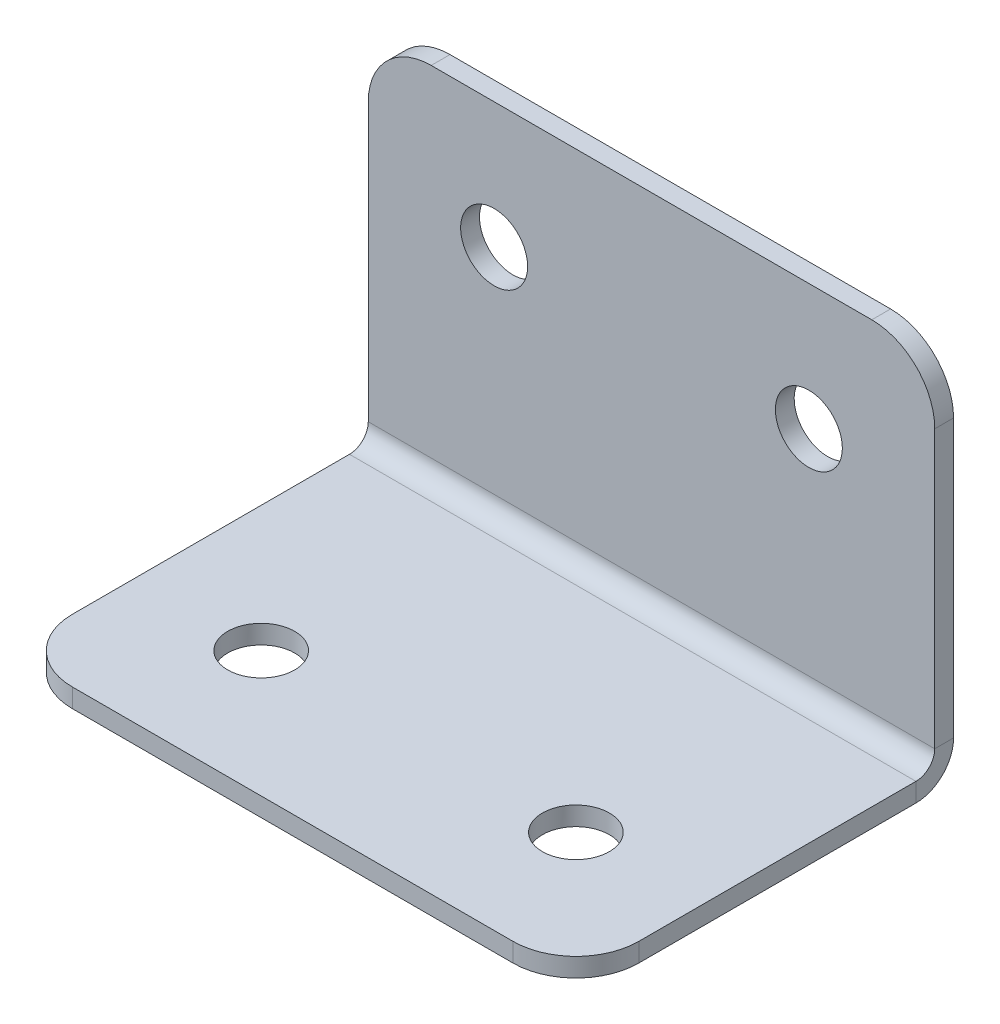
ISO-10303-21;
HEADER;
FILE_DESCRIPTION(('STEP AP214'),'2;1');
FILE_NAME('part.step','',(''),(''),'','','');
FILE_SCHEMA(('AUTOMOTIVE_DESIGN { 1 0 10303 214 1 1 1 1 }'));
ENDSEC;
DATA;
#1=APPLICATION_CONTEXT('core data for automotive mechanical design processes');
#2=APPLICATION_PROTOCOL_DEFINITION('international standard','automotive_design',2000,#1);
#3=PRODUCT_CONTEXT('',#1,'mechanical');
#4=PRODUCT('Part','Part','',(#3));
#5=PRODUCT_RELATED_PRODUCT_CATEGORY('part','',(#4));
#6=PRODUCT_DEFINITION_FORMATION('','',#4);
#7=PRODUCT_DEFINITION_CONTEXT('part definition',#1,'design');
#8=PRODUCT_DEFINITION('design','',#6,#7);
#9=PRODUCT_DEFINITION_SHAPE('','',#8);
#10=(LENGTH_UNIT() NAMED_UNIT(*) SI_UNIT(.MILLI.,.METRE.));
#11=(NAMED_UNIT(*) PLANE_ANGLE_UNIT() SI_UNIT($,.RADIAN.));
#12=(NAMED_UNIT(*) SI_UNIT($,.STERADIAN.) SOLID_ANGLE_UNIT());
#13=UNCERTAINTY_MEASURE_WITH_UNIT(LENGTH_MEASURE(1.E-05),#10,'distance_accuracy_value','');
#14=(GEOMETRIC_REPRESENTATION_CONTEXT(3) GLOBAL_UNCERTAINTY_ASSIGNED_CONTEXT((#13)) GLOBAL_UNIT_ASSIGNED_CONTEXT((#10,
#11,#12)) REPRESENTATION_CONTEXT('',''));
#15=CARTESIAN_POINT('',(0.,0.,0.));
#16=DIRECTION('',(0.,0.,1.));
#17=DIRECTION('',(1.,0.,0.));
#18=AXIS2_PLACEMENT_3D('',#15,#16,#17);
#19=CARTESIAN_POINT('',(28.575,1.89738,38.1));
#20=DIRECTION('',(-1.,0.,0.));
#21=DIRECTION('',(0.,0.,1.));
#22=AXIS2_PLACEMENT_3D('',#19,#20,#21);
#23=PLANE('',#22);
#24=DIRECTION('',(0.,0.,-1.));
#25=VECTOR('',#24,1.);
#26=CARTESIAN_POINT('',(28.575,1.89738,38.1));
#27=LINE('',#26,#25);
#28=CARTESIAN_POINT('',(28.575,1.89738,31.75));
#29=VERTEX_POINT('',#28);
#30=CARTESIAN_POINT('',(28.575,1.89737999999998,3.79475999999999));
#31=VERTEX_POINT('',#30);
#32=EDGE_CURVE('E209',#29,#31,#27,.T.);
#33=ORIENTED_EDGE('',*,*,#32,.F.);
#34=DIRECTION('',(0.,-1.,0.));
#35=VECTOR('',#34,1.);
#36=CARTESIAN_POINT('',(28.575,1.89738,31.75));
#37=LINE('',#36,#35);
#38=CARTESIAN_POINT('',(28.575,0.,31.75));
#39=VERTEX_POINT('',#38);
#40=EDGE_CURVE('E218',#29,#39,#37,.T.);
#41=ORIENTED_EDGE('',*,*,#40,.T.);
#42=DIRECTION('',(0.,0.,-1.));
#43=VECTOR('',#42,1.);
#44=CARTESIAN_POINT('',(28.575,0.,38.1));
#45=LINE('',#44,#43);
#46=CARTESIAN_POINT('',(28.575,0.,3.79475999999999));
#47=VERTEX_POINT('',#46);
#48=EDGE_CURVE('E207',#39,#47,#45,.T.);
#49=ORIENTED_EDGE('',*,*,#48,.T.);
#50=DIRECTION('',(0.,-1.,0.));
#51=VECTOR('',#50,1.);
#52=CARTESIAN_POINT('',(28.575,1.89737999999998,3.79475999999999));
#53=LINE('',#52,#51);
#54=EDGE_CURVE('E204',#31,#47,#53,.T.);
#55=ORIENTED_EDGE('',*,*,#54,.F.);
#56=EDGE_LOOP('',(#33,#41,#49,#55));
#57=FACE_BOUND('',#56,.T.);
#58=ADVANCED_FACE('F56',(#57),#23,.F.);
#59=CARTESIAN_POINT('',(-28.575,1.89738,38.1));
#60=DIRECTION('',(1.,0.,0.));
#61=DIRECTION('',(0.,0.,-1.));
#62=AXIS2_PLACEMENT_3D('',#59,#60,#61);
#63=PLANE('',#62);
#64=DIRECTION('',(0.,0.,1.));
#65=VECTOR('',#64,1.);
#66=CARTESIAN_POINT('',(-28.575,0.,38.1));
#67=LINE('',#66,#65);
#68=CARTESIAN_POINT('',(-28.575,0.,3.79475999999999));
#69=VERTEX_POINT('',#68);
#70=CARTESIAN_POINT('',(-28.575,0.,31.75));
#71=VERTEX_POINT('',#70);
#72=EDGE_CURVE('E220',#69,#71,#67,.T.);
#73=ORIENTED_EDGE('',*,*,#72,.T.);
#74=DIRECTION('',(0.,-1.,0.));
#75=VECTOR('',#74,1.);
#76=CARTESIAN_POINT('',(-28.575,1.89738,31.75));
#77=LINE('',#76,#75);
#78=CARTESIAN_POINT('',(-28.575,1.89738,31.75));
#79=VERTEX_POINT('',#78);
#80=EDGE_CURVE('E240',#71,#79,#77,.F.);
#81=ORIENTED_EDGE('',*,*,#80,.T.);
#82=DIRECTION('',(0.,0.,1.));
#83=VECTOR('',#82,1.);
#84=CARTESIAN_POINT('',(-28.575,1.89738,38.1));
#85=LINE('',#84,#83);
#86=CARTESIAN_POINT('',(-28.575,1.89737999999998,3.79475999999999));
#87=VERTEX_POINT('',#86);
#88=EDGE_CURVE('E211',#87,#79,#85,.T.);
#89=ORIENTED_EDGE('',*,*,#88,.F.);
#90=DIRECTION('',(0.,-1.,0.));
#91=VECTOR('',#90,1.);
#92=CARTESIAN_POINT('',(-28.575,1.89737999999998,3.79475999999999));
#93=LINE('',#92,#91);
#94=EDGE_CURVE('E196',#87,#69,#93,.T.);
#95=ORIENTED_EDGE('',*,*,#94,.T.);
#96=EDGE_LOOP('',(#73,#81,#89,#95));
#97=FACE_BOUND('',#96,.T.);
#98=ADVANCED_FACE('F286',(#97),#63,.F.);
#99=CARTESIAN_POINT('',(0.,1.89738,0.));
#100=DIRECTION('',(0.,-1.,0.));
#101=DIRECTION('',(0.,0.,-1.));
#102=AXIS2_PLACEMENT_3D('',#99,#100,#101);
#103=PLANE('',#102);
#104=CARTESIAN_POINT('',(-15.875,1.89738,25.4));
#105=DIRECTION('',(0.,1.,0.));
#106=DIRECTION('',(0.,0.,1.));
#107=AXIS2_PLACEMENT_3D('',#104,#105,#106);
#108=CIRCLE('',#107,3.3782);
#109=CARTESIAN_POINT('',(-15.875,1.89738,28.7782));
#110=VERTEX_POINT('',#109);
#111=EDGE_CURVE('E369',#110,#110,#108,.T.);
#112=ORIENTED_EDGE('',*,*,#111,.F.);
#113=EDGE_LOOP('',(#112));
#114=FACE_BOUND('',#113,.T.);
#115=CARTESIAN_POINT('',(15.875,1.89738,25.4));
#116=DIRECTION('',(0.,1.,0.));
#117=DIRECTION('',(0.,0.,1.));
#118=AXIS2_PLACEMENT_3D('',#115,#116,#117);
#119=CIRCLE('',#118,3.3782);
#120=CARTESIAN_POINT('',(15.875,1.89738,28.7782));
#121=VERTEX_POINT('',#120);
#122=EDGE_CURVE('E381',#121,#121,#119,.T.);
#123=ORIENTED_EDGE('',*,*,#122,.F.);
#124=EDGE_LOOP('',(#123));
#125=FACE_BOUND('',#124,.T.);
#126=DIRECTION('',(1.,0.,0.));
#127=VECTOR('',#126,1.);
#128=CARTESIAN_POINT('',(-28.575,1.89738,38.1));
#129=LINE('',#128,#127);
#130=CARTESIAN_POINT('',(-22.225,1.89738,38.1));
#131=VERTEX_POINT('',#130);
#132=CARTESIAN_POINT('',(22.225,1.89738,38.1));
#133=VERTEX_POINT('',#132);
#134=EDGE_CURVE('E215',#131,#133,#129,.T.);
#135=ORIENTED_EDGE('',*,*,#134,.T.);
#136=CARTESIAN_POINT('',(22.225,1.89738,31.75));
#137=DIRECTION('',(0.,-1.,0.));
#138=DIRECTION('',(0.,0.,-1.));
#139=AXIS2_PLACEMENT_3D('',#136,#137,#138);
#140=CIRCLE('',#139,6.35);
#141=EDGE_CURVE('E238',#133,#29,#140,.F.);
#142=ORIENTED_EDGE('',*,*,#141,.T.);
#143=ORIENTED_EDGE('',*,*,#32,.T.);
#144=DIRECTION('',(-1.,0.,0.));
#145=VECTOR('',#144,1.);
#146=CARTESIAN_POINT('',(-28.575,1.89737999999998,3.79475999999999));
#147=LINE('',#146,#145);
#148=EDGE_CURVE('E200',#87,#31,#147,.F.);
#149=ORIENTED_EDGE('',*,*,#148,.F.);
#150=ORIENTED_EDGE('',*,*,#88,.T.);
#151=CARTESIAN_POINT('',(-22.225,1.89738,31.75));
#152=DIRECTION('',(0.,-1.,0.));
#153=DIRECTION('',(0.,0.,-1.));
#154=AXIS2_PLACEMENT_3D('',#151,#152,#153);
#155=CIRCLE('',#154,6.35);
#156=EDGE_CURVE('E236',#79,#131,#155,.F.);
#157=ORIENTED_EDGE('',*,*,#156,.T.);
#158=EDGE_LOOP('',(#135,#142,#143,#149,#150,#157));
#159=FACE_BOUND('',#158,.T.);
#160=ADVANCED_FACE('F294',(#114,#125,#159),#103,.F.);
#161=CARTESIAN_POINT('',(0.,0.,0.));
#162=DIRECTION('',(0.,-1.,0.));
#163=DIRECTION('',(0.,0.,-1.));
#164=AXIS2_PLACEMENT_3D('',#161,#162,#163);
#165=PLANE('',#164);
#166=CARTESIAN_POINT('',(-15.875,0.,25.4));
#167=DIRECTION('',(0.,-1.,0.));
#168=DIRECTION('',(0.,0.,-1.));
#169=AXIS2_PLACEMENT_3D('',#166,#167,#168);
#170=CIRCLE('',#169,3.3782);
#171=CARTESIAN_POINT('',(-15.875,0.,22.0218));
#172=VERTEX_POINT('',#171);
#173=EDGE_CURVE('E378',#172,#172,#170,.T.);
#174=ORIENTED_EDGE('',*,*,#173,.F.);
#175=EDGE_LOOP('',(#174));
#176=FACE_BOUND('',#175,.T.);
#177=CARTESIAN_POINT('',(15.875,0.,25.4));
#178=DIRECTION('',(0.,-1.,0.));
#179=DIRECTION('',(0.,0.,-1.));
#180=AXIS2_PLACEMENT_3D('',#177,#178,#179);
#181=CIRCLE('',#180,3.3782);
#182=CARTESIAN_POINT('',(15.875,0.,22.0218));
#183=VERTEX_POINT('',#182);
#184=EDGE_CURVE('E193',#183,#183,#181,.T.);
#185=ORIENTED_EDGE('',*,*,#184,.F.);
#186=EDGE_LOOP('',(#185));
#187=FACE_BOUND('',#186,.T.);
#188=ORIENTED_EDGE('',*,*,#48,.F.);
#189=CARTESIAN_POINT('',(22.225,0.,31.75));
#190=DIRECTION('',(0.,-1.,0.));
#191=DIRECTION('',(0.,0.,-1.));
#192=AXIS2_PLACEMENT_3D('',#189,#190,#191);
#193=CIRCLE('',#192,6.35);
#194=CARTESIAN_POINT('',(22.225,0.,38.1));
#195=VERTEX_POINT('',#194);
#196=EDGE_CURVE('E229',#39,#195,#193,.T.);
#197=ORIENTED_EDGE('',*,*,#196,.T.);
#198=DIRECTION('',(1.,0.,0.));
#199=VECTOR('',#198,1.);
#200=CARTESIAN_POINT('',(-28.575,0.,38.1));
#201=LINE('',#200,#199);
#202=CARTESIAN_POINT('',(-22.225,0.,38.1));
#203=VERTEX_POINT('',#202);
#204=EDGE_CURVE('E212',#203,#195,#201,.T.);
#205=ORIENTED_EDGE('',*,*,#204,.F.);
#206=CARTESIAN_POINT('',(-22.225,0.,31.75));
#207=DIRECTION('',(0.,-1.,0.));
#208=DIRECTION('',(0.,0.,-1.));
#209=AXIS2_PLACEMENT_3D('',#206,#207,#208);
#210=CIRCLE('',#209,6.35);
#211=EDGE_CURVE('E227',#203,#71,#210,.T.);
#212=ORIENTED_EDGE('',*,*,#211,.T.);
#213=ORIENTED_EDGE('',*,*,#72,.F.);
#214=DIRECTION('',(-1.,0.,0.));
#215=VECTOR('',#214,1.);
#216=CARTESIAN_POINT('',(-28.575,0.,3.79475999999999));
#217=LINE('',#216,#215);
#218=EDGE_CURVE('E156',#69,#47,#217,.F.);
#219=ORIENTED_EDGE('',*,*,#218,.T.);
#220=EDGE_LOOP('',(#188,#197,#205,#212,#213,#219));
#221=FACE_BOUND('',#220,.T.);
#222=ADVANCED_FACE('F281',(#176,#187,#221),#165,.T.);
#223=CARTESIAN_POINT('',(-28.575,1.89738,38.1));
#224=DIRECTION('',(0.,0.,-1.));
#225=DIRECTION('',(-1.,0.,0.));
#226=AXIS2_PLACEMENT_3D('',#223,#224,#225);
#227=PLANE('',#226);
#228=ORIENTED_EDGE('',*,*,#204,.T.);
#229=DIRECTION('',(0.,-1.,0.));
#230=VECTOR('',#229,1.);
#231=CARTESIAN_POINT('',(22.225,1.89738,38.1));
#232=LINE('',#231,#230);
#233=EDGE_CURVE('E234',#195,#133,#232,.F.);
#234=ORIENTED_EDGE('',*,*,#233,.T.);
#235=ORIENTED_EDGE('',*,*,#134,.F.);
#236=DIRECTION('',(0.,-1.,0.));
#237=VECTOR('',#236,1.);
#238=CARTESIAN_POINT('',(-22.225,1.89738,38.1));
#239=LINE('',#238,#237);
#240=EDGE_CURVE('E231',#131,#203,#239,.T.);
#241=ORIENTED_EDGE('',*,*,#240,.T.);
#242=EDGE_LOOP('',(#228,#234,#235,#241));
#243=FACE_BOUND('',#242,.T.);
#244=ADVANCED_FACE('F297',(#243),#227,.F.);
#245=CARTESIAN_POINT('',(28.575,3.79475999999998,3.79475999999999));
#246=DIRECTION('',(1.,0.,0.));
#247=DIRECTION('',(0.,0.,-1.));
#248=AXIS2_PLACEMENT_3D('',#245,#246,#247);
#249=PLANE('',#248);
#250=DIRECTION('',(0.,0.,1.));
#251=VECTOR('',#250,1.);
#252=CARTESIAN_POINT('',(28.575,3.79476000000001,0.));
#253=LINE('',#252,#251);
#254=CARTESIAN_POINT('',(28.575,3.79475999999997,1.89737999999999));
#255=VERTEX_POINT('',#254);
#256=CARTESIAN_POINT('',(28.575,3.79475999999997,0.));
#257=VERTEX_POINT('',#256);
#258=EDGE_CURVE('E190',#255,#257,#253,.F.);
#259=ORIENTED_EDGE('',*,*,#258,.F.);
#260=CARTESIAN_POINT('',(28.575,3.79475999999998,3.79475999999999));
#261=DIRECTION('',(-1.,0.,0.));
#262=DIRECTION('',(0.,0.,1.));
#263=AXIS2_PLACEMENT_3D('',#260,#261,#262);
#264=CIRCLE('',#263,1.89738);
#265=EDGE_CURVE('E159',#31,#255,#264,.F.);
#266=ORIENTED_EDGE('',*,*,#265,.F.);
#267=ORIENTED_EDGE('',*,*,#54,.T.);
#268=CARTESIAN_POINT('',(28.575,3.79475999999998,3.79475999999999));
#269=DIRECTION('',(-1.,0.,0.));
#270=DIRECTION('',(0.,0.,1.));
#271=AXIS2_PLACEMENT_3D('',#268,#269,#270);
#272=CIRCLE('',#271,3.79476);
#273=EDGE_CURVE('E195',#47,#257,#272,.F.);
#274=ORIENTED_EDGE('',*,*,#273,.T.);
#275=EDGE_LOOP('',(#259,#266,#267,#274));
#276=FACE_BOUND('',#275,.T.);
#277=ADVANCED_FACE('F275',(#276),#249,.T.);
#278=CARTESIAN_POINT('',(-28.575,3.79475999999998,3.79475999999999));
#279=DIRECTION('',(1.,0.,0.));
#280=DIRECTION('',(0.,0.,-1.));
#281=AXIS2_PLACEMENT_3D('',#278,#279,#280);
#282=PLANE('',#281);
#283=CARTESIAN_POINT('',(-28.575,3.79475999999998,3.79475999999999));
#284=DIRECTION('',(-1.,0.,0.));
#285=DIRECTION('',(0.,0.,1.));
#286=AXIS2_PLACEMENT_3D('',#283,#284,#285);
#287=CIRCLE('',#286,1.89738);
#288=CARTESIAN_POINT('',(-28.575,3.79475999999997,1.89737999999999));
#289=VERTEX_POINT('',#288);
#290=EDGE_CURVE('E166',#289,#87,#287,.T.);
#291=ORIENTED_EDGE('',*,*,#290,.F.);
#292=DIRECTION('',(0.,0.,1.));
#293=VECTOR('',#292,1.);
#294=CARTESIAN_POINT('',(-28.575,3.79475999999999,1.89737999999999));
#295=LINE('',#294,#293);
#296=CARTESIAN_POINT('',(-28.575,3.79476000000001,0.));
#297=VERTEX_POINT('',#296);
#298=EDGE_CURVE('E163',#289,#297,#295,.F.);
#299=ORIENTED_EDGE('',*,*,#298,.T.);
#300=CARTESIAN_POINT('',(-28.575,3.79475999999998,3.79475999999999));
#301=DIRECTION('',(-1.,0.,0.));
#302=DIRECTION('',(0.,0.,1.));
#303=AXIS2_PLACEMENT_3D('',#300,#301,#302);
#304=CIRCLE('',#303,3.79476);
#305=EDGE_CURVE('E148',#297,#69,#304,.T.);
#306=ORIENTED_EDGE('',*,*,#305,.T.);
#307=ORIENTED_EDGE('',*,*,#94,.F.);
#308=EDGE_LOOP('',(#291,#299,#306,#307));
#309=FACE_BOUND('',#308,.T.);
#310=ADVANCED_FACE('F164',(#309),#282,.F.);
#311=CARTESIAN_POINT('',(-28.575,3.79475999999998,3.79475999999999));
#312=DIRECTION('',(-1.,0.,0.));
#313=DIRECTION('',(0.,0.,-1.));
#314=AXIS2_PLACEMENT_3D('',#311,#312,#313);
#315=CYLINDRICAL_SURFACE('',#314,3.79476);
#316=ORIENTED_EDGE('',*,*,#218,.F.);
#317=ORIENTED_EDGE('',*,*,#305,.F.);
#318=DIRECTION('',(-1.,0.,0.));
#319=VECTOR('',#318,1.);
#320=CARTESIAN_POINT('',(28.575,3.79476000000001,0.));
#321=LINE('',#320,#319);
#322=EDGE_CURVE('E153',#297,#257,#321,.F.);
#323=ORIENTED_EDGE('',*,*,#322,.T.);
#324=ORIENTED_EDGE('',*,*,#273,.F.);
#325=EDGE_LOOP('',(#316,#317,#323,#324));
#326=FACE_BOUND('',#325,.T.);
#327=ADVANCED_FACE('F150',(#326),#315,.T.);
#328=CARTESIAN_POINT('',(-28.575,3.79475999999998,3.79475999999999));
#329=DIRECTION('',(-1.,0.,0.));
#330=DIRECTION('',(0.,0.,-1.));
#331=AXIS2_PLACEMENT_3D('',#328,#329,#330);
#332=CYLINDRICAL_SURFACE('',#331,1.89738);
#333=ORIENTED_EDGE('',*,*,#148,.T.);
#334=ORIENTED_EDGE('',*,*,#265,.T.);
#335=DIRECTION('',(-1.,0.,0.));
#336=VECTOR('',#335,1.);
#337=CARTESIAN_POINT('',(28.575,3.79475999999999,1.89737999999999));
#338=LINE('',#337,#336);
#339=EDGE_CURVE('E168',#255,#289,#338,.T.);
#340=ORIENTED_EDGE('',*,*,#339,.T.);
#341=ORIENTED_EDGE('',*,*,#290,.T.);
#342=EDGE_LOOP('',(#333,#334,#340,#341));
#343=FACE_BOUND('',#342,.T.);
#344=ADVANCED_FACE('F270',(#343),#332,.F.);
#345=CARTESIAN_POINT('',(28.575,1.89737999999999,0.));
#346=DIRECTION('',(-1.,0.,0.));
#347=DIRECTION('',(0.,0.,1.));
#348=AXIS2_PLACEMENT_3D('',#345,#346,#347);
#349=PLANE('',#348);
#350=DIRECTION('',(0.,-1.,0.));
#351=VECTOR('',#350,1.);
#352=CARTESIAN_POINT('',(28.575,0.,0.));
#353=LINE('',#352,#351);
#354=CARTESIAN_POINT('',(28.575,31.75,-1.03548854600011E-13));
#355=VERTEX_POINT('',#354);
#356=EDGE_CURVE('E173',#355,#257,#353,.T.);
#357=ORIENTED_EDGE('',*,*,#356,.F.);
#358=DIRECTION('',(0.,0.,1.));
#359=VECTOR('',#358,1.);
#360=CARTESIAN_POINT('',(28.575,31.75,-1.03579344342084E-13));
#361=LINE('',#360,#359);
#362=CARTESIAN_POINT('',(28.575,31.75,1.8973799999999));
#363=VERTEX_POINT('',#362);
#364=EDGE_CURVE('E13',#355,#363,#361,.T.);
#365=ORIENTED_EDGE('',*,*,#364,.T.);
#366=DIRECTION('',(0.,1.,0.));
#367=VECTOR('',#366,1.);
#368=CARTESIAN_POINT('',(28.575,1.89738,1.89738));
#369=LINE('',#368,#367);
#370=EDGE_CURVE('E174',#363,#255,#369,.F.);
#371=ORIENTED_EDGE('',*,*,#370,.T.);
#372=ORIENTED_EDGE('',*,*,#258,.T.);
#373=EDGE_LOOP('',(#357,#365,#371,#372));
#374=FACE_BOUND('',#373,.T.);
#375=ADVANCED_FACE('F267',(#374),#349,.F.);
#376=CARTESIAN_POINT('',(-28.575,38.1,-1.25984292442816E-13));
#377=DIRECTION('',(1.,0.,0.));
#378=DIRECTION('',(0.,0.,-1.));
#379=AXIS2_PLACEMENT_3D('',#376,#377,#378);
#380=PLANE('',#379);
#381=DIRECTION('',(0.,-1.,0.));
#382=VECTOR('',#381,1.);
#383=CARTESIAN_POINT('',(-28.575,38.1,1.89737999999987));
#384=LINE('',#383,#382);
#385=CARTESIAN_POINT('',(-28.575,31.75,1.8973799999999));
#386=VERTEX_POINT('',#385);
#387=EDGE_CURVE('E186',#289,#386,#384,.F.);
#388=ORIENTED_EDGE('',*,*,#387,.T.);
#389=DIRECTION('',(0.,0.,1.));
#390=VECTOR('',#389,1.);
#391=CARTESIAN_POINT('',(-28.575,31.75,-1.03813385941162E-13));
#392=LINE('',#391,#390);
#393=CARTESIAN_POINT('',(-28.575,31.75,-1.03848741739719E-13));
#394=VERTEX_POINT('',#393);
#395=EDGE_CURVE('E79',#386,#394,#392,.F.);
#396=ORIENTED_EDGE('',*,*,#395,.T.);
#397=DIRECTION('',(0.,1.,0.));
#398=VECTOR('',#397,1.);
#399=CARTESIAN_POINT('',(-28.575,0.,0.));
#400=LINE('',#399,#398);
#401=EDGE_CURVE('E171',#297,#394,#400,.T.);
#402=ORIENTED_EDGE('',*,*,#401,.F.);
#403=ORIENTED_EDGE('',*,*,#298,.F.);
#404=EDGE_LOOP('',(#388,#396,#402,#403));
#405=FACE_BOUND('',#404,.T.);
#406=ADVANCED_FACE('F176',(#405),#380,.F.);
#407=CARTESIAN_POINT('',(0.,0.,0.));
#408=DIRECTION('',(0.,0.,1.));
#409=DIRECTION('',(0.,-1.,0.));
#410=AXIS2_PLACEMENT_3D('',#407,#408,#409);
#411=PLANE('',#410);
#412=CARTESIAN_POINT('',(-15.875,25.4,0.));
#413=DIRECTION('',(0.,0.,1.));
#414=DIRECTION('',(0.,-1.,0.));
#415=AXIS2_PLACEMENT_3D('',#412,#413,#414);
#416=CIRCLE('',#415,3.37819999999999);
#417=CARTESIAN_POINT('',(-15.875,22.0218,0.));
#418=VERTEX_POINT('',#417);
#419=EDGE_CURVE('E367',#418,#418,#416,.T.);
#420=ORIENTED_EDGE('',*,*,#419,.T.);
#421=EDGE_LOOP('',(#420));
#422=FACE_BOUND('',#421,.T.);
#423=CARTESIAN_POINT('',(15.875,25.4,0.));
#424=DIRECTION('',(0.,0.,1.));
#425=DIRECTION('',(0.,-1.,0.));
#426=AXIS2_PLACEMENT_3D('',#423,#424,#425);
#427=CIRCLE('',#426,3.37819999999999);
#428=CARTESIAN_POINT('',(15.875,22.0218,0.));
#429=VERTEX_POINT('',#428);
#430=EDGE_CURVE('E362',#429,#429,#427,.T.);
#431=ORIENTED_EDGE('',*,*,#430,.T.);
#432=EDGE_LOOP('',(#431));
#433=FACE_BOUND('',#432,.T.);
#434=ORIENTED_EDGE('',*,*,#401,.T.);
#435=CARTESIAN_POINT('',(-22.225,31.75,-1.03815420946418E-13));
#436=DIRECTION('',(0.,0.,1.));
#437=DIRECTION('',(0.,-1.,0.));
#438=AXIS2_PLACEMENT_3D('',#435,#436,#437);
#439=CIRCLE('',#438,6.35);
#440=CARTESIAN_POINT('',(-22.225,38.1,-1.25986327448072E-13));
#441=VERTEX_POINT('',#440);
#442=EDGE_CURVE('E64',#394,#441,#439,.F.);
#443=ORIENTED_EDGE('',*,*,#442,.T.);
#444=DIRECTION('',(1.,0.,0.));
#445=VECTOR('',#444,1.);
#446=CARTESIAN_POINT('',(0.,38.1,-1.25869704671519E-13));
#447=LINE('',#446,#445);
#448=CARTESIAN_POINT('',(22.225,38.1,-1.25753081894966E-13));
#449=VERTEX_POINT('',#448);
#450=EDGE_CURVE('E177',#441,#449,#447,.T.);
#451=ORIENTED_EDGE('',*,*,#450,.T.);
#452=CARTESIAN_POINT('',(22.225,31.75,-1.03582175393312E-13));
#453=DIRECTION('',(0.,0.,1.));
#454=DIRECTION('',(0.,-1.,0.));
#455=AXIS2_PLACEMENT_3D('',#452,#453,#454);
#456=CIRCLE('',#455,6.35);
#457=EDGE_CURVE('E71',#449,#355,#456,.F.);
#458=ORIENTED_EDGE('',*,*,#457,.T.);
#459=ORIENTED_EDGE('',*,*,#356,.T.);
#460=ORIENTED_EDGE('',*,*,#322,.F.);
#461=EDGE_LOOP('',(#434,#443,#451,#458,#459,#460));
#462=FACE_BOUND('',#461,.T.);
#463=ADVANCED_FACE('F170',(#422,#433,#462),#411,.F.);
#464=CARTESIAN_POINT('',(0.,0.,1.89738000000001));
#465=DIRECTION('',(0.,0.,1.));
#466=DIRECTION('',(0.,-1.,0.));
#467=AXIS2_PLACEMENT_3D('',#464,#465,#466);
#468=PLANE('',#467);
#469=CARTESIAN_POINT('',(-15.875,25.4,1.89738000000001));
#470=DIRECTION('',(0.,0.,1.));
#471=DIRECTION('',(1.,0.,0.));
#472=AXIS2_PLACEMENT_3D('',#469,#470,#471);
#473=CIRCLE('',#472,3.37819999999999);
#474=CARTESIAN_POINT('',(-12.4968,25.4,1.89738000000001));
#475=VERTEX_POINT('',#474);
#476=EDGE_CURVE('E372',#475,#475,#473,.T.);
#477=ORIENTED_EDGE('',*,*,#476,.F.);
#478=EDGE_LOOP('',(#477));
#479=FACE_BOUND('',#478,.T.);
#480=CARTESIAN_POINT('',(15.875,25.4,1.89738000000001));
#481=DIRECTION('',(0.,0.,1.));
#482=DIRECTION('',(1.,0.,0.));
#483=AXIS2_PLACEMENT_3D('',#480,#481,#482);
#484=CIRCLE('',#483,3.37819999999999);
#485=CARTESIAN_POINT('',(19.2532,25.4,1.89738000000001));
#486=VERTEX_POINT('',#485);
#487=EDGE_CURVE('E365',#486,#486,#484,.T.);
#488=ORIENTED_EDGE('',*,*,#487,.F.);
#489=EDGE_LOOP('',(#488));
#490=FACE_BOUND('',#489,.T.);
#491=DIRECTION('',(-1.,0.,0.));
#492=VECTOR('',#491,1.);
#493=CARTESIAN_POINT('',(28.575,38.1,1.89737999999987));
#494=LINE('',#493,#492);
#495=CARTESIAN_POINT('',(-22.225,38.1,1.89737999999987));
#496=VERTEX_POINT('',#495);
#497=CARTESIAN_POINT('',(22.225,38.1,1.89737999999987));
#498=VERTEX_POINT('',#497);
#499=EDGE_CURVE('E180',#496,#498,#494,.F.);
#500=ORIENTED_EDGE('',*,*,#499,.F.);
#501=CARTESIAN_POINT('',(-22.225,31.75,1.8973799999999));
#502=DIRECTION('',(0.,0.,1.));
#503=DIRECTION('',(0.,-1.,0.));
#504=AXIS2_PLACEMENT_3D('',#501,#502,#503);
#505=CIRCLE('',#504,6.35);
#506=EDGE_CURVE('E249',#496,#386,#505,.T.);
#507=ORIENTED_EDGE('',*,*,#506,.T.);
#508=ORIENTED_EDGE('',*,*,#387,.F.);
#509=ORIENTED_EDGE('',*,*,#339,.F.);
#510=ORIENTED_EDGE('',*,*,#370,.F.);
#511=CARTESIAN_POINT('',(22.225,31.75,1.8973799999999));
#512=DIRECTION('',(0.,0.,1.));
#513=DIRECTION('',(0.,-1.,0.));
#514=AXIS2_PLACEMENT_3D('',#511,#512,#513);
#515=CIRCLE('',#514,6.35);
#516=EDGE_CURVE('E247',#363,#498,#515,.T.);
#517=ORIENTED_EDGE('',*,*,#516,.T.);
#518=EDGE_LOOP('',(#500,#507,#508,#509,#510,#517));
#519=FACE_BOUND('',#518,.T.);
#520=ADVANCED_FACE('F261',(#479,#490,#519),#468,.T.);
#521=CARTESIAN_POINT('',(28.575,38.1,-1.25767452008319E-13));
#522=DIRECTION('',(0.,-1.,0.));
#523=DIRECTION('',(0.,0.,-1.));
#524=AXIS2_PLACEMENT_3D('',#521,#522,#523);
#525=PLANE('',#524);
#526=ORIENTED_EDGE('',*,*,#450,.F.);
#527=DIRECTION('',(0.,0.,1.));
#528=VECTOR('',#527,1.);
#529=CARTESIAN_POINT('',(-22.225,38.1,-1.26034018354725E-13));
#530=LINE('',#529,#528);
#531=EDGE_CURVE('E244',#441,#496,#530,.T.);
#532=ORIENTED_EDGE('',*,*,#531,.T.);
#533=ORIENTED_EDGE('',*,*,#499,.T.);
#534=DIRECTION('',(0.,0.,1.));
#535=VECTOR('',#534,1.);
#536=CARTESIAN_POINT('',(22.225,38.1,-1.25800772801619E-13));
#537=LINE('',#536,#535);
#538=EDGE_CURVE('E242',#498,#449,#537,.F.);
#539=ORIENTED_EDGE('',*,*,#538,.T.);
#540=EDGE_LOOP('',(#526,#532,#533,#539));
#541=FACE_BOUND('',#540,.T.);
#542=ADVANCED_FACE('F256',(#541),#525,.F.);
#543=CARTESIAN_POINT('',(15.875,1.89738,25.4));
#544=DIRECTION('',(0.,1.,0.));
#545=DIRECTION('',(0.,0.,1.));
#546=AXIS2_PLACEMENT_3D('',#543,#544,#545);
#547=CYLINDRICAL_SURFACE('',#546,3.3782);
#548=ORIENTED_EDGE('',*,*,#122,.T.);
#549=EDGE_LOOP('',(#548));
#550=FACE_BOUND('',#549,.T.);
#551=ORIENTED_EDGE('',*,*,#184,.T.);
#552=EDGE_LOOP('',(#551));
#553=FACE_BOUND('',#552,.T.);
#554=ADVANCED_FACE('F341',(#550,#553),#547,.F.);
#555=CARTESIAN_POINT('',(-15.875,1.89738,25.4));
#556=DIRECTION('',(0.,1.,0.));
#557=DIRECTION('',(0.,0.,1.));
#558=AXIS2_PLACEMENT_3D('',#555,#556,#557);
#559=CYLINDRICAL_SURFACE('',#558,3.3782);
#560=ORIENTED_EDGE('',*,*,#111,.T.);
#561=EDGE_LOOP('',(#560));
#562=FACE_BOUND('',#561,.T.);
#563=ORIENTED_EDGE('',*,*,#173,.T.);
#564=EDGE_LOOP('',(#563));
#565=FACE_BOUND('',#564,.T.);
#566=ADVANCED_FACE('F350',(#562,#565),#559,.F.);
#567=CARTESIAN_POINT('',(15.875,25.4,1.89738000000001));
#568=DIRECTION('',(0.,0.,1.));
#569=DIRECTION('',(1.,0.,0.));
#570=AXIS2_PLACEMENT_3D('',#567,#568,#569);
#571=CYLINDRICAL_SURFACE('',#570,3.37819999999999);
#572=ORIENTED_EDGE('',*,*,#430,.F.);
#573=EDGE_LOOP('',(#572));
#574=FACE_BOUND('',#573,.T.);
#575=ORIENTED_EDGE('',*,*,#487,.T.);
#576=EDGE_LOOP('',(#575));
#577=FACE_BOUND('',#576,.T.);
#578=ADVANCED_FACE('F309',(#574,#577),#571,.F.);
#579=CARTESIAN_POINT('',(-15.875,25.4,1.89738000000001));
#580=DIRECTION('',(0.,0.,1.));
#581=DIRECTION('',(1.,0.,0.));
#582=AXIS2_PLACEMENT_3D('',#579,#580,#581);
#583=CYLINDRICAL_SURFACE('',#582,3.37819999999999);
#584=ORIENTED_EDGE('',*,*,#419,.F.);
#585=EDGE_LOOP('',(#584));
#586=FACE_BOUND('',#585,.T.);
#587=ORIENTED_EDGE('',*,*,#476,.T.);
#588=EDGE_LOOP('',(#587));
#589=FACE_BOUND('',#588,.T.);
#590=ADVANCED_FACE('F302',(#586,#589),#583,.F.);
#591=CARTESIAN_POINT('',(22.225,1.89738,31.75));
#592=DIRECTION('',(0.,-1.,0.));
#593=DIRECTION('',(0.,0.,-1.));
#594=AXIS2_PLACEMENT_3D('',#591,#592,#593);
#595=CYLINDRICAL_SURFACE('',#594,6.35);
#596=ORIENTED_EDGE('',*,*,#141,.F.);
#597=ORIENTED_EDGE('',*,*,#233,.F.);
#598=ORIENTED_EDGE('',*,*,#196,.F.);
#599=ORIENTED_EDGE('',*,*,#40,.F.);
#600=EDGE_LOOP('',(#596,#597,#598,#599));
#601=FACE_BOUND('',#600,.T.);
#602=ADVANCED_FACE('F300',(#601),#595,.T.);
#603=CARTESIAN_POINT('',(-22.225,1.89738,31.75));
#604=DIRECTION('',(0.,-1.,0.));
#605=DIRECTION('',(0.,0.,-1.));
#606=AXIS2_PLACEMENT_3D('',#603,#604,#605);
#607=CYLINDRICAL_SURFACE('',#606,6.35);
#608=ORIENTED_EDGE('',*,*,#156,.F.);
#609=ORIENTED_EDGE('',*,*,#80,.F.);
#610=ORIENTED_EDGE('',*,*,#211,.F.);
#611=ORIENTED_EDGE('',*,*,#240,.F.);
#612=EDGE_LOOP('',(#608,#609,#610,#611));
#613=FACE_BOUND('',#612,.T.);
#614=ADVANCED_FACE('F290',(#613),#607,.T.);
#615=CARTESIAN_POINT('',(-22.225,31.75,-1.03863111853071E-13));
#616=DIRECTION('',(0.,0.,1.));
#617=DIRECTION('',(0.,-1.,0.));
#618=AXIS2_PLACEMENT_3D('',#615,#616,#617);
#619=CYLINDRICAL_SURFACE('',#618,6.35);
#620=ORIENTED_EDGE('',*,*,#442,.F.);
#621=ORIENTED_EDGE('',*,*,#395,.F.);
#622=ORIENTED_EDGE('',*,*,#506,.F.);
#623=ORIENTED_EDGE('',*,*,#531,.F.);
#624=EDGE_LOOP('',(#620,#621,#622,#623));
#625=FACE_BOUND('',#624,.T.);
#626=ADVANCED_FACE('F259',(#625),#619,.T.);
#627=CARTESIAN_POINT('',(22.225,31.75,-1.03612665135385E-13));
#628=DIRECTION('',(0.,0.,1.));
#629=DIRECTION('',(0.,-1.,0.));
#630=AXIS2_PLACEMENT_3D('',#627,#628,#629);
#631=CYLINDRICAL_SURFACE('',#630,6.35);
#632=ORIENTED_EDGE('',*,*,#457,.F.);
#633=ORIENTED_EDGE('',*,*,#538,.F.);
#634=ORIENTED_EDGE('',*,*,#516,.F.);
#635=ORIENTED_EDGE('',*,*,#364,.F.);
#636=EDGE_LOOP('',(#632,#633,#634,#635));
#637=FACE_BOUND('',#636,.T.);
#638=ADVANCED_FACE('F58',(#637),#631,.T.);
#639=CLOSED_SHELL('',(#58,#98,#160,#222,#244,#277,#310,#327,#344,#375,#406,#463,#520,#542,#554,
#566,#578,#590,#602,#614,#626,#638));
#640=MANIFOLD_SOLID_BREP('B2',#639);
#641=ADVANCED_BREP_SHAPE_REPRESENTATION('',(#18,#640),#14);
#642=SHAPE_DEFINITION_REPRESENTATION(#9,#641);
ENDSEC;
END-ISO-10303-21;
